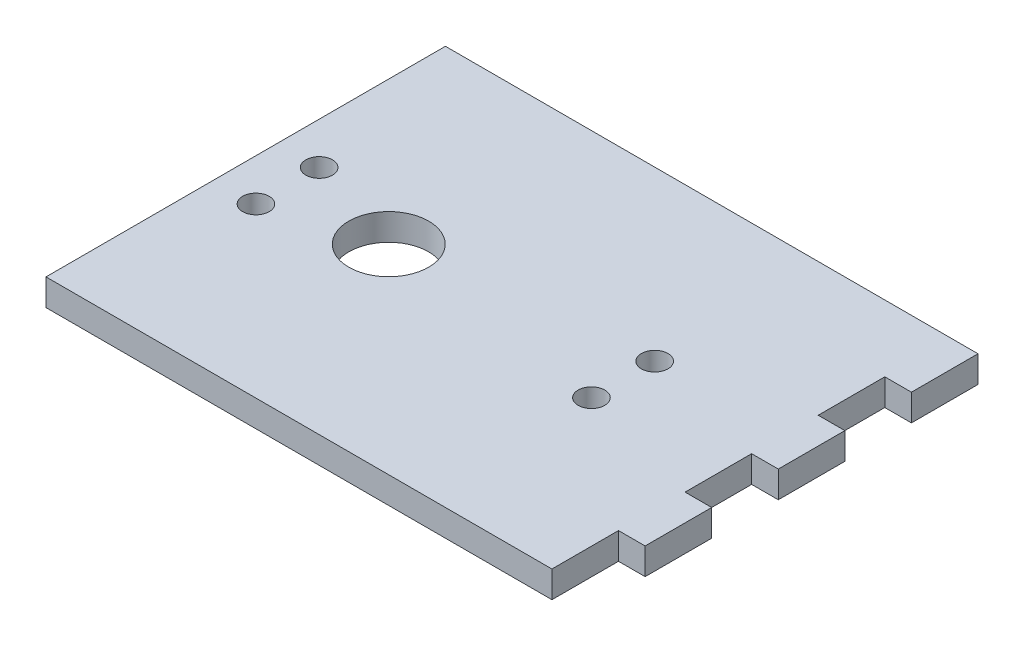
ISO-10303-21;
HEADER;
FILE_DESCRIPTION(('STEP AP214'),'2;1');
FILE_NAME('part.step','',(''),(''),'','','');
FILE_SCHEMA(('AUTOMOTIVE_DESIGN { 1 0 10303 214 1 1 1 1 }'));
ENDSEC;
DATA;
#1=APPLICATION_CONTEXT('core data for automotive mechanical design processes');
#2=APPLICATION_PROTOCOL_DEFINITION('international standard','automotive_design',2000,#1);
#3=PRODUCT_CONTEXT('',#1,'mechanical');
#4=PRODUCT('Part','Part','',(#3));
#5=PRODUCT_RELATED_PRODUCT_CATEGORY('part','',(#4));
#6=PRODUCT_DEFINITION_FORMATION('','',#4);
#7=PRODUCT_DEFINITION_CONTEXT('part definition',#1,'design');
#8=PRODUCT_DEFINITION('design','',#6,#7);
#9=PRODUCT_DEFINITION_SHAPE('','',#8);
#10=(LENGTH_UNIT() NAMED_UNIT(*) SI_UNIT(.MILLI.,.METRE.));
#11=(NAMED_UNIT(*) PLANE_ANGLE_UNIT() SI_UNIT($,.RADIAN.));
#12=(NAMED_UNIT(*) SI_UNIT($,.STERADIAN.) SOLID_ANGLE_UNIT());
#13=UNCERTAINTY_MEASURE_WITH_UNIT(LENGTH_MEASURE(1.E-05),#10,'distance_accuracy_value','');
#14=(GEOMETRIC_REPRESENTATION_CONTEXT(3) GLOBAL_UNCERTAINTY_ASSIGNED_CONTEXT((#13)) GLOBAL_UNIT_ASSIGNED_CONTEXT((#10,
#11,#12)) REPRESENTATION_CONTEXT('',''));
#15=CARTESIAN_POINT('',(0.,0.,0.));
#16=DIRECTION('',(0.,0.,1.));
#17=DIRECTION('',(1.,0.,0.));
#18=AXIS2_PLACEMENT_3D('',#15,#16,#17);
#19=CARTESIAN_POINT('',(0.,4.,0.));
#20=DIRECTION('',(0.,-1.,0.));
#21=DIRECTION('',(0.,0.,-1.));
#22=AXIS2_PLACEMENT_3D('',#19,#20,#21);
#23=PLANE('',#22);
#24=DIRECTION('',(0.,0.,-1.));
#25=VECTOR('',#24,1.);
#26=CARTESIAN_POINT('',(-9627.91873303764,4.,-15398.5093623727));
#27=LINE('',#26,#25);
#28=CARTESIAN_POINT('',(-9627.91873303764,4.,-15398.5093623727));
#29=VERTEX_POINT('',#28);
#30=CARTESIAN_POINT('',(-9627.91873303764,4.,-15408.5093623727));
#31=VERTEX_POINT('',#30);
#32=EDGE_CURVE('E193',#29,#31,#27,.T.);
#33=ORIENTED_EDGE('',*,*,#32,.T.);
#34=DIRECTION('',(-1.,0.,0.));
#35=VECTOR('',#34,1.);
#36=CARTESIAN_POINT('',(-9707.91873303764,4.,-15408.5093623727));
#37=LINE('',#36,#35);
#38=CARTESIAN_POINT('',(-9707.91873303764,4.,-15408.5093623727));
#39=VERTEX_POINT('',#38);
#40=EDGE_CURVE('E111',#31,#39,#37,.T.);
#41=ORIENTED_EDGE('',*,*,#40,.T.);
#42=DIRECTION('',(0.,0.,1.));
#43=VECTOR('',#42,1.);
#44=CARTESIAN_POINT('',(-9707.91873303764,4.,-15348.5093623727));
#45=LINE('',#44,#43);
#46=CARTESIAN_POINT('',(-9707.91873303764,4.,-15348.5093623727));
#47=VERTEX_POINT('',#46);
#48=EDGE_CURVE('E226',#39,#47,#45,.T.);
#49=ORIENTED_EDGE('',*,*,#48,.T.);
#50=DIRECTION('',(1.,0.,0.));
#51=VECTOR('',#50,1.);
#52=CARTESIAN_POINT('',(-9707.91873303764,4.,-15348.5093623727));
#53=LINE('',#52,#51);
#54=CARTESIAN_POINT('',(-9631.91873303764,4.,-15348.5093623727));
#55=VERTEX_POINT('',#54);
#56=EDGE_CURVE('E245',#47,#55,#53,.T.);
#57=ORIENTED_EDGE('',*,*,#56,.T.);
#58=DIRECTION('',(0.,0.,-1.));
#59=VECTOR('',#58,1.);
#60=CARTESIAN_POINT('',(-9631.91873303764,4.,-15358.5054020825));
#61=LINE('',#60,#59);
#62=CARTESIAN_POINT('',(-9631.91873303764,4.,-15358.5054020825));
#63=VERTEX_POINT('',#62);
#64=EDGE_CURVE('E242',#55,#63,#61,.T.);
#65=ORIENTED_EDGE('',*,*,#64,.T.);
#66=DIRECTION('',(1.,0.,0.));
#67=VECTOR('',#66,1.);
#68=CARTESIAN_POINT('',(-9627.91873303764,4.,-15358.5054020825));
#69=LINE('',#68,#67);
#70=CARTESIAN_POINT('',(-9627.91873303764,4.,-15358.5054020825));
#71=VERTEX_POINT('',#70);
#72=EDGE_CURVE('E244',#63,#71,#69,.T.);
#73=ORIENTED_EDGE('',*,*,#72,.T.);
#74=DIRECTION('',(0.,0.,-1.));
#75=VECTOR('',#74,1.);
#76=CARTESIAN_POINT('',(-9627.91873303764,4.,-15358.5054020825));
#77=LINE('',#76,#75);
#78=CARTESIAN_POINT('',(-9627.91873303764,4.,-15368.5093623727));
#79=VERTEX_POINT('',#78);
#80=EDGE_CURVE('E247',#71,#79,#77,.T.);
#81=ORIENTED_EDGE('',*,*,#80,.T.);
#82=DIRECTION('',(-1.,0.,0.));
#83=VECTOR('',#82,1.);
#84=CARTESIAN_POINT('',(-9631.91873303764,4.,-15368.5093623727));
#85=LINE('',#84,#83);
#86=CARTESIAN_POINT('',(-9631.91873303764,4.,-15368.5093623727));
#87=VERTEX_POINT('',#86);
#88=EDGE_CURVE('E253',#79,#87,#85,.T.);
#89=ORIENTED_EDGE('',*,*,#88,.T.);
#90=DIRECTION('',(0.,0.,-1.));
#91=VECTOR('',#90,1.);
#92=CARTESIAN_POINT('',(-9631.91873303764,4.,-15378.5093623727));
#93=LINE('',#92,#91);
#94=CARTESIAN_POINT('',(-9631.91873303764,4.,-15378.5093623727));
#95=VERTEX_POINT('',#94);
#96=EDGE_CURVE('E255',#87,#95,#93,.T.);
#97=ORIENTED_EDGE('',*,*,#96,.T.);
#98=DIRECTION('',(1.,0.,0.));
#99=VECTOR('',#98,1.);
#100=CARTESIAN_POINT('',(-9627.91873303764,4.,-15378.5093623727));
#101=LINE('',#100,#99);
#102=CARTESIAN_POINT('',(-9627.91873303764,4.,-15378.5093623727));
#103=VERTEX_POINT('',#102);
#104=EDGE_CURVE('E257',#95,#103,#101,.T.);
#105=ORIENTED_EDGE('',*,*,#104,.T.);
#106=DIRECTION('',(0.,0.,-1.));
#107=VECTOR('',#106,1.);
#108=CARTESIAN_POINT('',(-9627.91873303764,4.,-15378.5093623727));
#109=LINE('',#108,#107);
#110=CARTESIAN_POINT('',(-9627.91873303764,4.,-15388.5093623727));
#111=VERTEX_POINT('',#110);
#112=EDGE_CURVE('E148',#103,#111,#109,.T.);
#113=ORIENTED_EDGE('',*,*,#112,.T.);
#114=DIRECTION('',(-1.,0.,0.));
#115=VECTOR('',#114,1.);
#116=CARTESIAN_POINT('',(-9631.91873303764,4.,-15388.5093623727));
#117=LINE('',#116,#115);
#118=CARTESIAN_POINT('',(-9631.91873303764,4.,-15388.5093623727));
#119=VERTEX_POINT('',#118);
#120=EDGE_CURVE('E142',#111,#119,#117,.T.);
#121=ORIENTED_EDGE('',*,*,#120,.T.);
#122=DIRECTION('',(0.,0.,-1.));
#123=VECTOR('',#122,1.);
#124=CARTESIAN_POINT('',(-9631.91873303764,4.,-15398.5093623727));
#125=LINE('',#124,#123);
#126=CARTESIAN_POINT('',(-9631.91873303764,4.,-15398.5093623727));
#127=VERTEX_POINT('',#126);
#128=EDGE_CURVE('E146',#119,#127,#125,.T.);
#129=ORIENTED_EDGE('',*,*,#128,.T.);
#130=DIRECTION('',(1.,0.,0.));
#131=VECTOR('',#130,1.);
#132=CARTESIAN_POINT('',(-9627.91873303764,4.,-15398.5093623727));
#133=LINE('',#132,#131);
#134=EDGE_CURVE('E50',#127,#29,#133,.T.);
#135=ORIENTED_EDGE('',*,*,#134,.T.);
#136=EDGE_LOOP('',(#33,#41,#49,#57,#65,#73,#81,#89,#97,#105,#113,#121,#129,#135));
#137=FACE_BOUND('',#136,.T.);
#138=CARTESIAN_POINT('',(-9686.43431723086,4.,-15378.5093623727));
#139=DIRECTION('',(0.,1.,0.));
#140=DIRECTION('',(0.,0.,1.));
#141=AXIS2_PLACEMENT_3D('',#138,#139,#140);
#142=CIRCLE('',#141,6.00000000000018);
#143=CARTESIAN_POINT('',(-9686.43431723086,4.,-15372.5093623727));
#144=VERTEX_POINT('',#143);
#145=EDGE_CURVE('E170',#144,#144,#142,.T.);
#146=ORIENTED_EDGE('',*,*,#145,.F.);
#147=EDGE_LOOP('',(#146));
#148=FACE_BOUND('',#147,.T.);
#149=CARTESIAN_POINT('',(-9651.2343172309,4.,-15373.7593623727));
#150=DIRECTION('',(0.,1.,0.));
#151=DIRECTION('',(0.,0.,1.));
#152=AXIS2_PLACEMENT_3D('',#149,#150,#151);
#153=CIRCLE('',#152,1.99999999997558);
#154=CARTESIAN_POINT('',(-9651.2343172309,4.,-15371.7593623727));
#155=VERTEX_POINT('',#154);
#156=EDGE_CURVE('E331',#155,#155,#153,.T.);
#157=ORIENTED_EDGE('',*,*,#156,.F.);
#158=EDGE_LOOP('',(#157));
#159=FACE_BOUND('',#158,.T.);
#160=CARTESIAN_POINT('',(-9651.2343172309,4.,-15383.2593623727));
#161=DIRECTION('',(0.,1.,0.));
#162=DIRECTION('',(0.,0.,1.));
#163=AXIS2_PLACEMENT_3D('',#160,#161,#162);
#164=CIRCLE('',#163,1.99999999997728);
#165=CARTESIAN_POINT('',(-9651.2343172309,4.,-15381.2593623727));
#166=VERTEX_POINT('',#165);
#167=EDGE_CURVE('E325',#166,#166,#164,.T.);
#168=ORIENTED_EDGE('',*,*,#167,.F.);
#169=EDGE_LOOP('',(#168));
#170=FACE_BOUND('',#169,.T.);
#171=CARTESIAN_POINT('',(-9701.6343172309,4.,-15373.7593623727));
#172=DIRECTION('',(0.,1.,0.));
#173=DIRECTION('',(0.,0.,1.));
#174=AXIS2_PLACEMENT_3D('',#171,#172,#173);
#175=CIRCLE('',#174,1.99999999997728);
#176=CARTESIAN_POINT('',(-9701.6343172309,4.,-15371.7593623727));
#177=VERTEX_POINT('',#176);
#178=EDGE_CURVE('E319',#177,#177,#175,.T.);
#179=ORIENTED_EDGE('',*,*,#178,.F.);
#180=EDGE_LOOP('',(#179));
#181=FACE_BOUND('',#180,.T.);
#182=CARTESIAN_POINT('',(-9701.6343172309,4.,-15383.2593623727));
#183=DIRECTION('',(0.,1.,0.));
#184=DIRECTION('',(0.,0.,1.));
#185=AXIS2_PLACEMENT_3D('',#182,#183,#184);
#186=CIRCLE('',#185,1.99999999997728);
#187=CARTESIAN_POINT('',(-9701.6343172309,4.,-15381.2593623727));
#188=VERTEX_POINT('',#187);
#189=EDGE_CURVE('E310',#188,#188,#186,.T.);
#190=ORIENTED_EDGE('',*,*,#189,.F.);
#191=EDGE_LOOP('',(#190));
#192=FACE_BOUND('',#191,.T.);
#193=ADVANCED_FACE('F33',(#137,#148,#159,#170,#181,#192),#23,.F.);
#194=CARTESIAN_POINT('',(0.,0.,0.));
#195=DIRECTION('',(0.,-1.,0.));
#196=DIRECTION('',(0.,0.,-1.));
#197=AXIS2_PLACEMENT_3D('',#194,#195,#196);
#198=PLANE('',#197);
#199=CARTESIAN_POINT('',(-9701.6343172309,0.,-15373.7593623727));
#200=DIRECTION('',(0.,1.,0.));
#201=DIRECTION('',(0.,0.,1.));
#202=AXIS2_PLACEMENT_3D('',#199,#200,#201);
#203=CIRCLE('',#202,1.99999999997728);
#204=CARTESIAN_POINT('',(-9701.6343172309,0.,-15371.7593623727));
#205=VERTEX_POINT('',#204);
#206=EDGE_CURVE('E316',#205,#205,#203,.T.);
#207=ORIENTED_EDGE('',*,*,#206,.T.);
#208=EDGE_LOOP('',(#207));
#209=FACE_BOUND('',#208,.T.);
#210=CARTESIAN_POINT('',(-9651.2343172309,0.,-15373.7593623727));
#211=DIRECTION('',(0.,1.,0.));
#212=DIRECTION('',(0.,0.,1.));
#213=AXIS2_PLACEMENT_3D('',#210,#211,#212);
#214=CIRCLE('',#213,1.99999999997558);
#215=CARTESIAN_POINT('',(-9651.2343172309,0.,-15371.7593623727));
#216=VERTEX_POINT('',#215);
#217=EDGE_CURVE('E328',#216,#216,#214,.T.);
#218=ORIENTED_EDGE('',*,*,#217,.T.);
#219=EDGE_LOOP('',(#218));
#220=FACE_BOUND('',#219,.T.);
#221=DIRECTION('',(0.,0.,-1.));
#222=VECTOR('',#221,1.);
#223=CARTESIAN_POINT('',(-9627.91873303764,0.,-15398.5093623727));
#224=LINE('',#223,#222);
#225=CARTESIAN_POINT('',(-9627.91873303764,0.,-15398.5093623727));
#226=VERTEX_POINT('',#225);
#227=CARTESIAN_POINT('',(-9627.91873303764,0.,-15408.5093623727));
#228=VERTEX_POINT('',#227);
#229=EDGE_CURVE('E166',#226,#228,#224,.T.);
#230=ORIENTED_EDGE('',*,*,#229,.F.);
#231=DIRECTION('',(1.,0.,0.));
#232=VECTOR('',#231,1.);
#233=CARTESIAN_POINT('',(-9627.91873303764,0.,-15398.5093623727));
#234=LINE('',#233,#232);
#235=CARTESIAN_POINT('',(-9631.91873303764,0.,-15398.5093623727));
#236=VERTEX_POINT('',#235);
#237=EDGE_CURVE('E103',#236,#226,#234,.T.);
#238=ORIENTED_EDGE('',*,*,#237,.F.);
#239=DIRECTION('',(0.,0.,-1.));
#240=VECTOR('',#239,1.);
#241=CARTESIAN_POINT('',(-9631.91873303764,0.,-15398.5093623727));
#242=LINE('',#241,#240);
#243=CARTESIAN_POINT('',(-9631.91873303764,0.,-15388.5093623727));
#244=VERTEX_POINT('',#243);
#245=EDGE_CURVE('E97',#244,#236,#242,.T.);
#246=ORIENTED_EDGE('',*,*,#245,.F.);
#247=DIRECTION('',(-1.,0.,0.));
#248=VECTOR('',#247,1.);
#249=CARTESIAN_POINT('',(-9631.91873303764,0.,-15388.5093623727));
#250=LINE('',#249,#248);
#251=CARTESIAN_POINT('',(-9627.91873303764,0.,-15388.5093623727));
#252=VERTEX_POINT('',#251);
#253=EDGE_CURVE('E156',#252,#244,#250,.T.);
#254=ORIENTED_EDGE('',*,*,#253,.F.);
#255=DIRECTION('',(0.,0.,-1.));
#256=VECTOR('',#255,1.);
#257=CARTESIAN_POINT('',(-9627.91873303764,0.,-15378.5093623727));
#258=LINE('',#257,#256);
#259=CARTESIAN_POINT('',(-9627.91873303764,0.,-15378.5093623727));
#260=VERTEX_POINT('',#259);
#261=EDGE_CURVE('E188',#260,#252,#258,.T.);
#262=ORIENTED_EDGE('',*,*,#261,.F.);
#263=DIRECTION('',(1.,0.,0.));
#264=VECTOR('',#263,1.);
#265=CARTESIAN_POINT('',(-9627.91873303764,0.,-15378.5093623727));
#266=LINE('',#265,#264);
#267=CARTESIAN_POINT('',(-9631.91873303764,0.,-15378.5093623727));
#268=VERTEX_POINT('',#267);
#269=EDGE_CURVE('E186',#268,#260,#266,.T.);
#270=ORIENTED_EDGE('',*,*,#269,.F.);
#271=DIRECTION('',(0.,0.,-1.));
#272=VECTOR('',#271,1.);
#273=CARTESIAN_POINT('',(-9631.91873303764,0.,-15378.5093623727));
#274=LINE('',#273,#272);
#275=CARTESIAN_POINT('',(-9631.91873303764,0.,-15368.5093623727));
#276=VERTEX_POINT('',#275);
#277=EDGE_CURVE('E184',#276,#268,#274,.T.);
#278=ORIENTED_EDGE('',*,*,#277,.F.);
#279=DIRECTION('',(-1.,0.,0.));
#280=VECTOR('',#279,1.);
#281=CARTESIAN_POINT('',(-9631.91873303764,0.,-15368.5093623727));
#282=LINE('',#281,#280);
#283=CARTESIAN_POINT('',(-9627.91873303764,0.,-15368.5093623727));
#284=VERTEX_POINT('',#283);
#285=EDGE_CURVE('E182',#284,#276,#282,.T.);
#286=ORIENTED_EDGE('',*,*,#285,.F.);
#287=DIRECTION('',(0.,0.,-1.));
#288=VECTOR('',#287,1.);
#289=CARTESIAN_POINT('',(-9627.91873303764,0.,-15358.5054020825));
#290=LINE('',#289,#288);
#291=CARTESIAN_POINT('',(-9627.91873303764,0.,-15358.5054020825));
#292=VERTEX_POINT('',#291);
#293=EDGE_CURVE('E180',#292,#284,#290,.T.);
#294=ORIENTED_EDGE('',*,*,#293,.F.);
#295=DIRECTION('',(1.,0.,0.));
#296=VECTOR('',#295,1.);
#297=CARTESIAN_POINT('',(-9627.91873303764,0.,-15358.5054020825));
#298=LINE('',#297,#296);
#299=CARTESIAN_POINT('',(-9631.91873303764,0.,-15358.5054020825));
#300=VERTEX_POINT('',#299);
#301=EDGE_CURVE('E178',#300,#292,#298,.T.);
#302=ORIENTED_EDGE('',*,*,#301,.F.);
#303=DIRECTION('',(0.,0.,-1.));
#304=VECTOR('',#303,1.);
#305=CARTESIAN_POINT('',(-9631.91873303764,0.,-15358.5054020825));
#306=LINE('',#305,#304);
#307=CARTESIAN_POINT('',(-9631.91873303764,0.,-15348.5093623727));
#308=VERTEX_POINT('',#307);
#309=EDGE_CURVE('E176',#308,#300,#306,.T.);
#310=ORIENTED_EDGE('',*,*,#309,.F.);
#311=DIRECTION('',(1.,0.,0.));
#312=VECTOR('',#311,1.);
#313=CARTESIAN_POINT('',(-9707.91873303764,0.,-15348.5093623727));
#314=LINE('',#313,#312);
#315=CARTESIAN_POINT('',(-9707.91873303764,0.,-15348.5093623727));
#316=VERTEX_POINT('',#315);
#317=EDGE_CURVE('E174',#316,#308,#314,.T.);
#318=ORIENTED_EDGE('',*,*,#317,.F.);
#319=DIRECTION('',(0.,0.,1.));
#320=VECTOR('',#319,1.);
#321=CARTESIAN_POINT('',(-9707.91873303764,0.,-15348.5093623727));
#322=LINE('',#321,#320);
#323=CARTESIAN_POINT('',(-9707.91873303764,0.,-15408.5093623727));
#324=VERTEX_POINT('',#323);
#325=EDGE_CURVE('E172',#324,#316,#322,.T.);
#326=ORIENTED_EDGE('',*,*,#325,.F.);
#327=DIRECTION('',(-1.,0.,0.));
#328=VECTOR('',#327,1.);
#329=CARTESIAN_POINT('',(-9707.91873303764,0.,-15408.5093623727));
#330=LINE('',#329,#328);
#331=EDGE_CURVE('E169',#228,#324,#330,.T.);
#332=ORIENTED_EDGE('',*,*,#331,.F.);
#333=EDGE_LOOP('',(#230,#238,#246,#254,#262,#270,#278,#286,#294,#302,#310,#318,#326,#332));
#334=FACE_BOUND('',#333,.T.);
#335=CARTESIAN_POINT('',(-9686.43431723086,0.,-15378.5093623727));
#336=DIRECTION('',(0.,1.,0.));
#337=DIRECTION('',(0.,0.,1.));
#338=AXIS2_PLACEMENT_3D('',#335,#336,#337);
#339=CIRCLE('',#338,6.00000000000018);
#340=CARTESIAN_POINT('',(-9686.43431723086,0.,-15372.5093623727));
#341=VERTEX_POINT('',#340);
#342=EDGE_CURVE('E334',#341,#341,#339,.T.);
#343=ORIENTED_EDGE('',*,*,#342,.T.);
#344=EDGE_LOOP('',(#343));
#345=FACE_BOUND('',#344,.T.);
#346=CARTESIAN_POINT('',(-9651.2343172309,0.,-15383.2593623727));
#347=DIRECTION('',(0.,1.,0.));
#348=DIRECTION('',(0.,0.,1.));
#349=AXIS2_PLACEMENT_3D('',#346,#347,#348);
#350=CIRCLE('',#349,1.99999999997728);
#351=CARTESIAN_POINT('',(-9651.2343172309,0.,-15381.2593623727));
#352=VERTEX_POINT('',#351);
#353=EDGE_CURVE('E322',#352,#352,#350,.T.);
#354=ORIENTED_EDGE('',*,*,#353,.T.);
#355=EDGE_LOOP('',(#354));
#356=FACE_BOUND('',#355,.T.);
#357=CARTESIAN_POINT('',(-9701.6343172309,0.,-15383.2593623727));
#358=DIRECTION('',(0.,1.,0.));
#359=DIRECTION('',(0.,0.,1.));
#360=AXIS2_PLACEMENT_3D('',#357,#358,#359);
#361=CIRCLE('',#360,1.99999999997728);
#362=CARTESIAN_POINT('',(-9701.6343172309,0.,-15381.2593623727));
#363=VERTEX_POINT('',#362);
#364=EDGE_CURVE('E313',#363,#363,#361,.T.);
#365=ORIENTED_EDGE('',*,*,#364,.T.);
#366=EDGE_LOOP('',(#365));
#367=FACE_BOUND('',#366,.T.);
#368=ADVANCED_FACE('F230',(#209,#220,#334,#345,#356,#367),#198,.T.);
#369=CARTESIAN_POINT('',(-9627.91873303764,4.,-15398.5093623727));
#370=DIRECTION('',(-1.,0.,0.));
#371=DIRECTION('',(0.,0.,1.));
#372=AXIS2_PLACEMENT_3D('',#369,#370,#371);
#373=PLANE('',#372);
#374=ORIENTED_EDGE('',*,*,#229,.T.);
#375=DIRECTION('',(0.,-1.,0.));
#376=VECTOR('',#375,1.);
#377=CARTESIAN_POINT('',(-9627.91873303764,4.,-15408.5093623727));
#378=LINE('',#377,#376);
#379=EDGE_CURVE('E11',#31,#228,#378,.T.);
#380=ORIENTED_EDGE('',*,*,#379,.F.);
#381=ORIENTED_EDGE('',*,*,#32,.F.);
#382=DIRECTION('',(0.,-1.,0.));
#383=VECTOR('',#382,1.);
#384=CARTESIAN_POINT('',(-9627.91873303764,4.,-15398.5093623727));
#385=LINE('',#384,#383);
#386=EDGE_CURVE('E162',#29,#226,#385,.T.);
#387=ORIENTED_EDGE('',*,*,#386,.T.);
#388=EDGE_LOOP('',(#374,#380,#381,#387));
#389=FACE_BOUND('',#388,.T.);
#390=ADVANCED_FACE('F35',(#389),#373,.F.);
#391=CARTESIAN_POINT('',(-9707.91873303764,4.,-15408.5093623727));
#392=DIRECTION('',(0.,0.,1.));
#393=DIRECTION('',(1.,0.,0.));
#394=AXIS2_PLACEMENT_3D('',#391,#392,#393);
#395=PLANE('',#394);
#396=ORIENTED_EDGE('',*,*,#331,.T.);
#397=DIRECTION('',(0.,-1.,0.));
#398=VECTOR('',#397,1.);
#399=CARTESIAN_POINT('',(-9707.91873303764,4.,-15408.5093623727));
#400=LINE('',#399,#398);
#401=EDGE_CURVE('E42',#39,#324,#400,.T.);
#402=ORIENTED_EDGE('',*,*,#401,.F.);
#403=ORIENTED_EDGE('',*,*,#40,.F.);
#404=ORIENTED_EDGE('',*,*,#379,.T.);
#405=EDGE_LOOP('',(#396,#402,#403,#404));
#406=FACE_BOUND('',#405,.T.);
#407=ADVANCED_FACE('F475',(#406),#395,.F.);
#408=CARTESIAN_POINT('',(-9707.91873303764,4.,-15348.5093623727));
#409=DIRECTION('',(1.,0.,0.));
#410=DIRECTION('',(0.,0.,-1.));
#411=AXIS2_PLACEMENT_3D('',#408,#409,#410);
#412=PLANE('',#411);
#413=ORIENTED_EDGE('',*,*,#325,.T.);
#414=DIRECTION('',(0.,-1.,0.));
#415=VECTOR('',#414,1.);
#416=CARTESIAN_POINT('',(-9707.91873303764,4.,-15348.5093623727));
#417=LINE('',#416,#415);
#418=EDGE_CURVE('E218',#47,#316,#417,.T.);
#419=ORIENTED_EDGE('',*,*,#418,.F.);
#420=ORIENTED_EDGE('',*,*,#48,.F.);
#421=ORIENTED_EDGE('',*,*,#401,.T.);
#422=EDGE_LOOP('',(#413,#419,#420,#421));
#423=FACE_BOUND('',#422,.T.);
#424=ADVANCED_FACE('F224',(#423),#412,.F.);
#425=CARTESIAN_POINT('',(-9707.91873303764,4.,-15348.5093623727));
#426=DIRECTION('',(0.,0.,-1.));
#427=DIRECTION('',(-1.,0.,0.));
#428=AXIS2_PLACEMENT_3D('',#425,#426,#427);
#429=PLANE('',#428);
#430=ORIENTED_EDGE('',*,*,#317,.T.);
#431=DIRECTION('',(0.,-1.,0.));
#432=VECTOR('',#431,1.);
#433=CARTESIAN_POINT('',(-9631.91873303764,4.,-15348.5093623727));
#434=LINE('',#433,#432);
#435=EDGE_CURVE('E215',#55,#308,#434,.T.);
#436=ORIENTED_EDGE('',*,*,#435,.F.);
#437=ORIENTED_EDGE('',*,*,#56,.F.);
#438=ORIENTED_EDGE('',*,*,#418,.T.);
#439=EDGE_LOOP('',(#430,#436,#437,#438));
#440=FACE_BOUND('',#439,.T.);
#441=ADVANCED_FACE('F236',(#440),#429,.F.);
#442=CARTESIAN_POINT('',(-9631.91873303764,4.,-15358.5054020825));
#443=DIRECTION('',(-1.,0.,0.));
#444=DIRECTION('',(0.,0.,1.));
#445=AXIS2_PLACEMENT_3D('',#442,#443,#444);
#446=PLANE('',#445);
#447=ORIENTED_EDGE('',*,*,#309,.T.);
#448=DIRECTION('',(0.,-1.,0.));
#449=VECTOR('',#448,1.);
#450=CARTESIAN_POINT('',(-9631.91873303764,4.,-15358.5054020825));
#451=LINE('',#450,#449);
#452=EDGE_CURVE('E212',#63,#300,#451,.T.);
#453=ORIENTED_EDGE('',*,*,#452,.F.);
#454=ORIENTED_EDGE('',*,*,#64,.F.);
#455=ORIENTED_EDGE('',*,*,#435,.T.);
#456=EDGE_LOOP('',(#447,#453,#454,#455));
#457=FACE_BOUND('',#456,.T.);
#458=ADVANCED_FACE('F240',(#457),#446,.F.);
#459=CARTESIAN_POINT('',(-9627.91873303764,4.,-15358.5054020825));
#460=DIRECTION('',(0.,0.,-1.));
#461=DIRECTION('',(-1.,0.,0.));
#462=AXIS2_PLACEMENT_3D('',#459,#460,#461);
#463=PLANE('',#462);
#464=ORIENTED_EDGE('',*,*,#301,.T.);
#465=DIRECTION('',(0.,-1.,0.));
#466=VECTOR('',#465,1.);
#467=CARTESIAN_POINT('',(-9627.91873303764,4.,-15358.5054020825));
#468=LINE('',#467,#466);
#469=EDGE_CURVE('E209',#71,#292,#468,.T.);
#470=ORIENTED_EDGE('',*,*,#469,.F.);
#471=ORIENTED_EDGE('',*,*,#72,.F.);
#472=ORIENTED_EDGE('',*,*,#452,.T.);
#473=EDGE_LOOP('',(#464,#470,#471,#472));
#474=FACE_BOUND('',#473,.T.);
#475=ADVANCED_FACE('F440',(#474),#463,.F.);
#476=CARTESIAN_POINT('',(-9627.91873303764,4.,-15358.5054020825));
#477=DIRECTION('',(-1.,0.,0.));
#478=DIRECTION('',(0.,0.,1.));
#479=AXIS2_PLACEMENT_3D('',#476,#477,#478);
#480=PLANE('',#479);
#481=ORIENTED_EDGE('',*,*,#293,.T.);
#482=DIRECTION('',(0.,-1.,0.));
#483=VECTOR('',#482,1.);
#484=CARTESIAN_POINT('',(-9627.91873303764,4.,-15368.5093623727));
#485=LINE('',#484,#483);
#486=EDGE_CURVE('E206',#79,#284,#485,.T.);
#487=ORIENTED_EDGE('',*,*,#486,.F.);
#488=ORIENTED_EDGE('',*,*,#80,.F.);
#489=ORIENTED_EDGE('',*,*,#469,.T.);
#490=EDGE_LOOP('',(#481,#487,#488,#489));
#491=FACE_BOUND('',#490,.T.);
#492=ADVANCED_FACE('F430',(#491),#480,.F.);
#493=CARTESIAN_POINT('',(-9631.91873303764,4.,-15368.5093623727));
#494=DIRECTION('',(0.,0.,1.));
#495=DIRECTION('',(1.,0.,0.));
#496=AXIS2_PLACEMENT_3D('',#493,#494,#495);
#497=PLANE('',#496);
#498=ORIENTED_EDGE('',*,*,#285,.T.);
#499=DIRECTION('',(0.,-1.,0.));
#500=VECTOR('',#499,1.);
#501=CARTESIAN_POINT('',(-9631.91873303764,4.,-15368.5093623727));
#502=LINE('',#501,#500);
#503=EDGE_CURVE('E203',#87,#276,#502,.T.);
#504=ORIENTED_EDGE('',*,*,#503,.F.);
#505=ORIENTED_EDGE('',*,*,#88,.F.);
#506=ORIENTED_EDGE('',*,*,#486,.T.);
#507=EDGE_LOOP('',(#498,#504,#505,#506));
#508=FACE_BOUND('',#507,.T.);
#509=ADVANCED_FACE('F420',(#508),#497,.F.);
#510=CARTESIAN_POINT('',(-9631.91873303764,4.,-15378.5093623727));
#511=DIRECTION('',(-1.,0.,0.));
#512=DIRECTION('',(0.,0.,1.));
#513=AXIS2_PLACEMENT_3D('',#510,#511,#512);
#514=PLANE('',#513);
#515=ORIENTED_EDGE('',*,*,#277,.T.);
#516=DIRECTION('',(0.,-1.,0.));
#517=VECTOR('',#516,1.);
#518=CARTESIAN_POINT('',(-9631.91873303764,4.,-15378.5093623727));
#519=LINE('',#518,#517);
#520=EDGE_CURVE('E200',#95,#268,#519,.T.);
#521=ORIENTED_EDGE('',*,*,#520,.F.);
#522=ORIENTED_EDGE('',*,*,#96,.F.);
#523=ORIENTED_EDGE('',*,*,#503,.T.);
#524=EDGE_LOOP('',(#515,#521,#522,#523));
#525=FACE_BOUND('',#524,.T.);
#526=ADVANCED_FACE('F411',(#525),#514,.F.);
#527=CARTESIAN_POINT('',(-9627.91873303764,4.,-15378.5093623727));
#528=DIRECTION('',(0.,0.,-1.));
#529=DIRECTION('',(-1.,0.,0.));
#530=AXIS2_PLACEMENT_3D('',#527,#528,#529);
#531=PLANE('',#530);
#532=ORIENTED_EDGE('',*,*,#269,.T.);
#533=DIRECTION('',(0.,-1.,0.));
#534=VECTOR('',#533,1.);
#535=CARTESIAN_POINT('',(-9627.91873303764,4.,-15378.5093623727));
#536=LINE('',#535,#534);
#537=EDGE_CURVE('E197',#103,#260,#536,.T.);
#538=ORIENTED_EDGE('',*,*,#537,.F.);
#539=ORIENTED_EDGE('',*,*,#104,.F.);
#540=ORIENTED_EDGE('',*,*,#520,.T.);
#541=EDGE_LOOP('',(#532,#538,#539,#540));
#542=FACE_BOUND('',#541,.T.);
#543=ADVANCED_FACE('F263',(#542),#531,.F.);
#544=CARTESIAN_POINT('',(-9627.91873303764,4.,-15378.5093623727));
#545=DIRECTION('',(-1.,0.,0.));
#546=DIRECTION('',(0.,0.,1.));
#547=AXIS2_PLACEMENT_3D('',#544,#545,#546);
#548=PLANE('',#547);
#549=ORIENTED_EDGE('',*,*,#261,.T.);
#550=DIRECTION('',(0.,-1.,0.));
#551=VECTOR('',#550,1.);
#552=CARTESIAN_POINT('',(-9627.91873303764,4.,-15388.5093623727));
#553=LINE('',#552,#551);
#554=EDGE_CURVE('E157',#111,#252,#553,.T.);
#555=ORIENTED_EDGE('',*,*,#554,.F.);
#556=ORIENTED_EDGE('',*,*,#112,.F.);
#557=ORIENTED_EDGE('',*,*,#537,.T.);
#558=EDGE_LOOP('',(#549,#555,#556,#557));
#559=FACE_BOUND('',#558,.T.);
#560=ADVANCED_FACE('F267',(#559),#548,.F.);
#561=CARTESIAN_POINT('',(-9631.91873303764,4.,-15388.5093623727));
#562=DIRECTION('',(0.,0.,1.));
#563=DIRECTION('',(1.,0.,0.));
#564=AXIS2_PLACEMENT_3D('',#561,#562,#563);
#565=PLANE('',#564);
#566=ORIENTED_EDGE('',*,*,#253,.T.);
#567=DIRECTION('',(0.,-1.,0.));
#568=VECTOR('',#567,1.);
#569=CARTESIAN_POINT('',(-9631.91873303764,4.,-15388.5093623727));
#570=LINE('',#569,#568);
#571=EDGE_CURVE('E153',#119,#244,#570,.T.);
#572=ORIENTED_EDGE('',*,*,#571,.F.);
#573=ORIENTED_EDGE('',*,*,#120,.F.);
#574=ORIENTED_EDGE('',*,*,#554,.T.);
#575=EDGE_LOOP('',(#566,#572,#573,#574));
#576=FACE_BOUND('',#575,.T.);
#577=ADVANCED_FACE('F154',(#576),#565,.F.);
#578=CARTESIAN_POINT('',(-9631.91873303764,4.,-15398.5093623727));
#579=DIRECTION('',(-1.,0.,0.));
#580=DIRECTION('',(0.,0.,1.));
#581=AXIS2_PLACEMENT_3D('',#578,#579,#580);
#582=PLANE('',#581);
#583=ORIENTED_EDGE('',*,*,#245,.T.);
#584=DIRECTION('',(0.,-1.,0.));
#585=VECTOR('',#584,1.);
#586=CARTESIAN_POINT('',(-9631.91873303764,4.,-15398.5093623727));
#587=LINE('',#586,#585);
#588=EDGE_CURVE('E158',#127,#236,#587,.T.);
#589=ORIENTED_EDGE('',*,*,#588,.F.);
#590=ORIENTED_EDGE('',*,*,#128,.F.);
#591=ORIENTED_EDGE('',*,*,#571,.T.);
#592=EDGE_LOOP('',(#583,#589,#590,#591));
#593=FACE_BOUND('',#592,.T.);
#594=ADVANCED_FACE('F160',(#593),#582,.F.);
#595=CARTESIAN_POINT('',(-9627.91873303764,4.,-15398.5093623727));
#596=DIRECTION('',(0.,0.,-1.));
#597=DIRECTION('',(-1.,0.,0.));
#598=AXIS2_PLACEMENT_3D('',#595,#596,#597);
#599=PLANE('',#598);
#600=ORIENTED_EDGE('',*,*,#237,.T.);
#601=ORIENTED_EDGE('',*,*,#386,.F.);
#602=ORIENTED_EDGE('',*,*,#134,.F.);
#603=ORIENTED_EDGE('',*,*,#588,.T.);
#604=EDGE_LOOP('',(#600,#601,#602,#603));
#605=FACE_BOUND('',#604,.T.);
#606=ADVANCED_FACE('F271',(#605),#599,.F.);
#607=CARTESIAN_POINT('',(-9686.43431723086,4.,-15378.5093623727));
#608=DIRECTION('',(0.,-1.,0.));
#609=DIRECTION('',(0.,0.,-1.));
#610=AXIS2_PLACEMENT_3D('',#607,#608,#609);
#611=CYLINDRICAL_SURFACE('',#610,6.00000000000018);
#612=ORIENTED_EDGE('',*,*,#145,.T.);
#613=EDGE_LOOP('',(#612));
#614=FACE_BOUND('',#613,.T.);
#615=ORIENTED_EDGE('',*,*,#342,.F.);
#616=EDGE_LOOP('',(#615));
#617=FACE_BOUND('',#616,.T.);
#618=ADVANCED_FACE('F273',(#614,#617),#611,.F.);
#619=CARTESIAN_POINT('',(-9651.2343172309,4.,-15373.7593623727));
#620=DIRECTION('',(0.,-1.,0.));
#621=DIRECTION('',(0.,0.,-1.));
#622=AXIS2_PLACEMENT_3D('',#619,#620,#621);
#623=CYLINDRICAL_SURFACE('',#622,1.99999999997558);
#624=ORIENTED_EDGE('',*,*,#156,.T.);
#625=EDGE_LOOP('',(#624));
#626=FACE_BOUND('',#625,.T.);
#627=ORIENTED_EDGE('',*,*,#217,.F.);
#628=EDGE_LOOP('',(#627));
#629=FACE_BOUND('',#628,.T.);
#630=ADVANCED_FACE('F279',(#626,#629),#623,.F.);
#631=CARTESIAN_POINT('',(-9651.2343172309,4.,-15383.2593623727));
#632=DIRECTION('',(0.,-1.,0.));
#633=DIRECTION('',(0.,0.,-1.));
#634=AXIS2_PLACEMENT_3D('',#631,#632,#633);
#635=CYLINDRICAL_SURFACE('',#634,1.99999999997728);
#636=ORIENTED_EDGE('',*,*,#167,.T.);
#637=EDGE_LOOP('',(#636));
#638=FACE_BOUND('',#637,.T.);
#639=ORIENTED_EDGE('',*,*,#353,.F.);
#640=EDGE_LOOP('',(#639));
#641=FACE_BOUND('',#640,.T.);
#642=ADVANCED_FACE('F293',(#638,#641),#635,.F.);
#643=CARTESIAN_POINT('',(-9701.6343172309,4.,-15373.7593623727));
#644=DIRECTION('',(0.,-1.,0.));
#645=DIRECTION('',(0.,0.,-1.));
#646=AXIS2_PLACEMENT_3D('',#643,#644,#645);
#647=CYLINDRICAL_SURFACE('',#646,1.99999999997728);
#648=ORIENTED_EDGE('',*,*,#178,.T.);
#649=EDGE_LOOP('',(#648));
#650=FACE_BOUND('',#649,.T.);
#651=ORIENTED_EDGE('',*,*,#206,.F.);
#652=EDGE_LOOP('',(#651));
#653=FACE_BOUND('',#652,.T.);
#654=ADVANCED_FACE('F297',(#650,#653),#647,.F.);
#655=CARTESIAN_POINT('',(-9701.6343172309,4.,-15383.2593623727));
#656=DIRECTION('',(0.,-1.,0.));
#657=DIRECTION('',(0.,0.,-1.));
#658=AXIS2_PLACEMENT_3D('',#655,#656,#657);
#659=CYLINDRICAL_SURFACE('',#658,1.99999999997728);
#660=ORIENTED_EDGE('',*,*,#189,.T.);
#661=EDGE_LOOP('',(#660));
#662=FACE_BOUND('',#661,.T.);
#663=ORIENTED_EDGE('',*,*,#364,.F.);
#664=EDGE_LOOP('',(#663));
#665=FACE_BOUND('',#664,.T.);
#666=ADVANCED_FACE('F301',(#662,#665),#659,.F.);
#667=CLOSED_SHELL('',(#193,#368,#390,#407,#424,#441,#458,#475,#492,#509,#526,#543,#560,#577,
#594,#606,#618,#630,#642,#654,#666));
#668=MANIFOLD_SOLID_BREP('B2',#667);
#669=ADVANCED_BREP_SHAPE_REPRESENTATION('',(#18,#668),#14);
#670=SHAPE_DEFINITION_REPRESENTATION(#9,#669);
ENDSEC;
END-ISO-10303-21;
